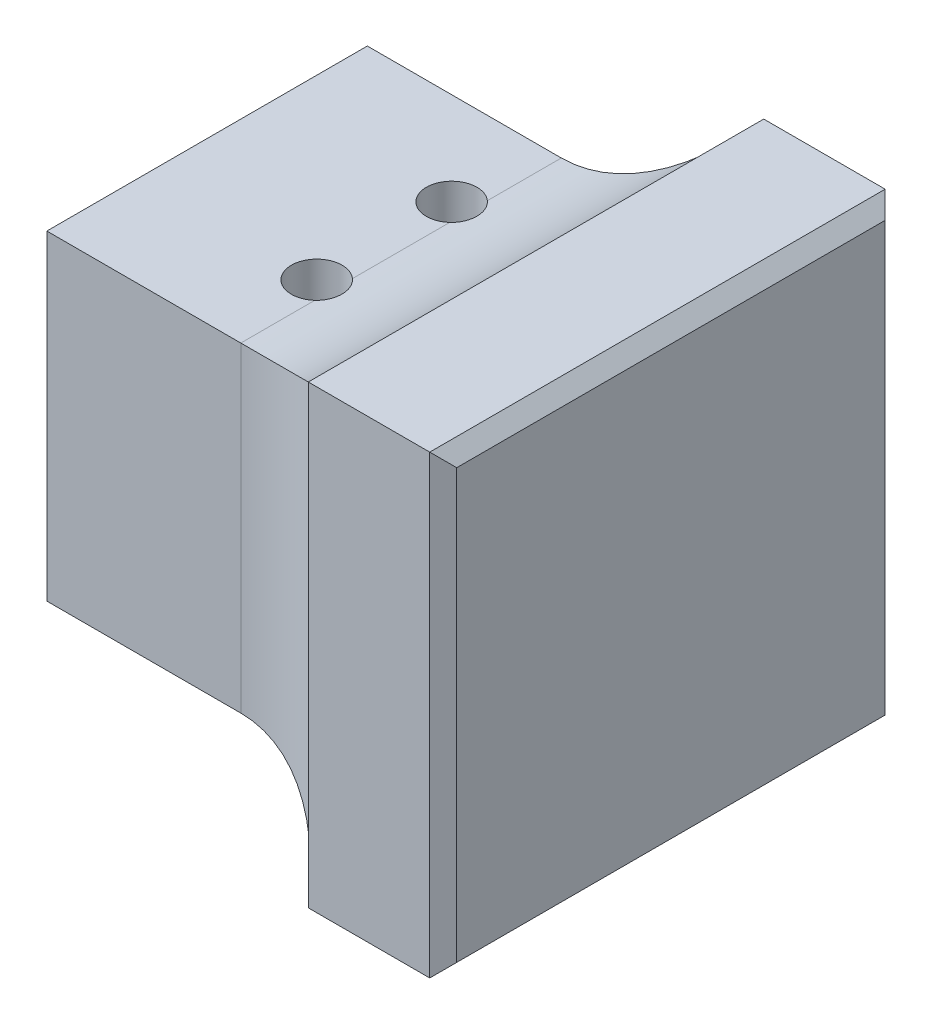
ISO-10303-21;
HEADER;
FILE_DESCRIPTION(('STEP AP214'),'2;1');
FILE_NAME('part.step','',(''),(''),'','','');
FILE_SCHEMA(('AUTOMOTIVE_DESIGN { 1 0 10303 214 1 1 1 1 }'));
ENDSEC;
DATA;
#1=APPLICATION_CONTEXT('core data for automotive mechanical design processes');
#2=APPLICATION_PROTOCOL_DEFINITION('international standard','automotive_design',2000,#1);
#3=PRODUCT_CONTEXT('',#1,'mechanical');
#4=PRODUCT('Part','Part','',(#3));
#5=PRODUCT_RELATED_PRODUCT_CATEGORY('part','',(#4));
#6=PRODUCT_DEFINITION_FORMATION('','',#4);
#7=PRODUCT_DEFINITION_CONTEXT('part definition',#1,'design');
#8=PRODUCT_DEFINITION('design','',#6,#7);
#9=PRODUCT_DEFINITION_SHAPE('','',#8);
#10=(LENGTH_UNIT() NAMED_UNIT(*) SI_UNIT(.MILLI.,.METRE.));
#11=(NAMED_UNIT(*) PLANE_ANGLE_UNIT() SI_UNIT($,.RADIAN.));
#12=(NAMED_UNIT(*) SI_UNIT($,.STERADIAN.) SOLID_ANGLE_UNIT());
#13=UNCERTAINTY_MEASURE_WITH_UNIT(LENGTH_MEASURE(1.E-05),#10,'distance_accuracy_value','');
#14=(GEOMETRIC_REPRESENTATION_CONTEXT(3) GLOBAL_UNCERTAINTY_ASSIGNED_CONTEXT((#13)) GLOBAL_UNIT_ASSIGNED_CONTEXT((#10,
#11,#12)) REPRESENTATION_CONTEXT('',''));
#15=CARTESIAN_POINT('',(0.,0.,0.));
#16=DIRECTION('',(0.,0.,1.));
#17=DIRECTION('',(1.,0.,0.));
#18=AXIS2_PLACEMENT_3D('',#15,#16,#17);
#19=CARTESIAN_POINT('',(0.,19.,0.));
#20=DIRECTION('',(0.,-1.,0.));
#21=DIRECTION('',(0.,0.,-1.));
#22=AXIS2_PLACEMENT_3D('',#19,#20,#21);
#23=PLANE('',#22);
#24=DIRECTION('',(1.,0.,0.));
#25=VECTOR('',#24,1.);
#26=CARTESIAN_POINT('',(0.,19.,0.));
#27=LINE('',#26,#25);
#28=CARTESIAN_POINT('',(1.50000000000001,19.,0.));
#29=VERTEX_POINT('',#28);
#30=CARTESIAN_POINT('',(13.,19.,0.));
#31=VERTEX_POINT('',#30);
#32=EDGE_CURVE('E208',#29,#31,#27,.T.);
#33=ORIENTED_EDGE('',*,*,#32,.T.);
#34=DIRECTION('',(0.,0.,1.));
#35=VECTOR('',#34,1.);
#36=CARTESIAN_POINT('',(13.,19.,0.));
#37=LINE('',#36,#35);
#38=CARTESIAN_POINT('',(13.,19.,-4.3819660112501));
#39=VERTEX_POINT('',#38);
#40=EDGE_CURVE('E257',#31,#39,#37,.F.);
#41=ORIENTED_EDGE('',*,*,#40,.T.);
#42=CARTESIAN_POINT('',(12.,19.,-5.5));
#43=DIRECTION('',(0.,1.,0.));
#44=DIRECTION('',(0.,0.,1.));
#45=AXIS2_PLACEMENT_3D('',#42,#43,#44);
#46=CIRCLE('',#45,1.5);
#47=CARTESIAN_POINT('',(13.,19.,-6.6180339887499));
#48=VERTEX_POINT('',#47);
#49=EDGE_CURVE('E194',#48,#39,#46,.T.);
#50=ORIENTED_EDGE('',*,*,#49,.F.);
#51=DIRECTION('',(0.,0.,1.));
#52=VECTOR('',#51,1.);
#53=CARTESIAN_POINT('',(13.,19.,0.));
#54=LINE('',#53,#52);
#55=CARTESIAN_POINT('',(13.,19.,-12.3819660112501));
#56=VERTEX_POINT('',#55);
#57=EDGE_CURVE('E255',#48,#56,#54,.F.);
#58=ORIENTED_EDGE('',*,*,#57,.T.);
#59=CARTESIAN_POINT('',(12.,19.,-13.5));
#60=DIRECTION('',(0.,1.,0.));
#61=DIRECTION('',(0.,0.,1.));
#62=AXIS2_PLACEMENT_3D('',#59,#60,#61);
#63=CIRCLE('',#62,1.5);
#64=CARTESIAN_POINT('',(13.,19.,-14.6180339887499));
#65=VERTEX_POINT('',#64);
#66=EDGE_CURVE('E202',#65,#56,#63,.T.);
#67=ORIENTED_EDGE('',*,*,#66,.F.);
#68=DIRECTION('',(0.,0.,1.));
#69=VECTOR('',#68,1.);
#70=CARTESIAN_POINT('',(13.,19.,0.));
#71=LINE('',#70,#69);
#72=CARTESIAN_POINT('',(13.,19.,-19.));
#73=VERTEX_POINT('',#72);
#74=EDGE_CURVE('E253',#65,#73,#71,.F.);
#75=ORIENTED_EDGE('',*,*,#74,.T.);
#76=DIRECTION('',(-1.,0.,0.));
#77=VECTOR('',#76,1.);
#78=CARTESIAN_POINT('',(0.,19.,-19.));
#79=LINE('',#78,#77);
#80=CARTESIAN_POINT('',(1.50000000000001,19.,-19.));
#81=VERTEX_POINT('',#80);
#82=EDGE_CURVE('E211',#73,#81,#79,.T.);
#83=ORIENTED_EDGE('',*,*,#82,.T.);
#84=DIRECTION('',(0.,0.,1.));
#85=VECTOR('',#84,1.);
#86=CARTESIAN_POINT('',(1.50000000000001,19.,0.));
#87=LINE('',#86,#85);
#88=EDGE_CURVE('E229',#81,#29,#87,.T.);
#89=ORIENTED_EDGE('',*,*,#88,.T.);
#90=EDGE_LOOP('',(#33,#41,#50,#58,#67,#75,#83,#89));
#91=FACE_BOUND('',#90,.T.);
#92=ADVANCED_FACE('F34',(#91),#23,.F.);
#93=CARTESIAN_POINT('',(0.,0.,0.));
#94=DIRECTION('',(0.,-1.,0.));
#95=DIRECTION('',(0.,0.,-1.));
#96=AXIS2_PLACEMENT_3D('',#93,#94,#95);
#97=PLANE('',#96);
#98=DIRECTION('',(-1.,0.,0.));
#99=VECTOR('',#98,1.);
#100=CARTESIAN_POINT('',(0.,0.,-19.));
#101=LINE('',#100,#99);
#102=CARTESIAN_POINT('',(13.,0.,-19.));
#103=VERTEX_POINT('',#102);
#104=CARTESIAN_POINT('',(1.50000000000001,0.,-19.));
#105=VERTEX_POINT('',#104);
#106=EDGE_CURVE('E212',#103,#105,#101,.T.);
#107=ORIENTED_EDGE('',*,*,#106,.F.);
#108=DIRECTION('',(0.,0.,1.));
#109=VECTOR('',#108,1.);
#110=CARTESIAN_POINT('',(13.,0.,0.));
#111=LINE('',#110,#109);
#112=CARTESIAN_POINT('',(13.,0.,-14.6180339887499));
#113=VERTEX_POINT('',#112);
#114=EDGE_CURVE('E249',#103,#113,#111,.T.);
#115=ORIENTED_EDGE('',*,*,#114,.T.);
#116=CARTESIAN_POINT('',(12.,0.,-13.5));
#117=DIRECTION('',(0.,1.,0.));
#118=DIRECTION('',(0.,0.,1.));
#119=AXIS2_PLACEMENT_3D('',#116,#117,#118);
#120=CIRCLE('',#119,1.5);
#121=CARTESIAN_POINT('',(13.,0.,-12.3819660112501));
#122=VERTEX_POINT('',#121);
#123=EDGE_CURVE('E197',#113,#122,#120,.T.);
#124=ORIENTED_EDGE('',*,*,#123,.T.);
#125=DIRECTION('',(0.,0.,1.));
#126=VECTOR('',#125,1.);
#127=CARTESIAN_POINT('',(13.,0.,0.));
#128=LINE('',#127,#126);
#129=CARTESIAN_POINT('',(13.,0.,-6.6180339887499));
#130=VERTEX_POINT('',#129);
#131=EDGE_CURVE('E247',#122,#130,#128,.T.);
#132=ORIENTED_EDGE('',*,*,#131,.T.);
#133=CARTESIAN_POINT('',(12.,0.,-5.5));
#134=DIRECTION('',(0.,1.,0.));
#135=DIRECTION('',(0.,0.,1.));
#136=AXIS2_PLACEMENT_3D('',#133,#134,#135);
#137=CIRCLE('',#136,1.5);
#138=CARTESIAN_POINT('',(13.,0.,-4.3819660112501));
#139=VERTEX_POINT('',#138);
#140=EDGE_CURVE('E198',#130,#139,#137,.T.);
#141=ORIENTED_EDGE('',*,*,#140,.T.);
#142=DIRECTION('',(0.,0.,1.));
#143=VECTOR('',#142,1.);
#144=CARTESIAN_POINT('',(13.,0.,0.));
#145=LINE('',#144,#143);
#146=CARTESIAN_POINT('',(13.,0.,0.));
#147=VERTEX_POINT('',#146);
#148=EDGE_CURVE('E236',#139,#147,#145,.T.);
#149=ORIENTED_EDGE('',*,*,#148,.T.);
#150=DIRECTION('',(1.,0.,0.));
#151=VECTOR('',#150,1.);
#152=CARTESIAN_POINT('',(0.,0.,0.));
#153=LINE('',#152,#151);
#154=CARTESIAN_POINT('',(1.50000000000001,0.,0.));
#155=VERTEX_POINT('',#154);
#156=EDGE_CURVE('E205',#155,#147,#153,.T.);
#157=ORIENTED_EDGE('',*,*,#156,.F.);
#158=DIRECTION('',(0.,0.,-1.));
#159=VECTOR('',#158,1.);
#160=CARTESIAN_POINT('',(1.50000000000001,0.,-19.));
#161=LINE('',#160,#159);
#162=EDGE_CURVE('E233',#155,#105,#161,.T.);
#163=ORIENTED_EDGE('',*,*,#162,.T.);
#164=EDGE_LOOP('',(#107,#115,#124,#132,#141,#149,#157,#163));
#165=FACE_BOUND('',#164,.T.);
#166=ADVANCED_FACE('F337',(#165),#97,.T.);
#167=CARTESIAN_POINT('',(0.,19.,0.));
#168=DIRECTION('',(1.,0.,0.));
#169=DIRECTION('',(0.,0.,-1.));
#170=AXIS2_PLACEMENT_3D('',#167,#168,#169);
#171=PLANE('',#170);
#172=DIRECTION('',(0.,0.,-1.));
#173=VECTOR('',#172,1.);
#174=CARTESIAN_POINT('',(0.,17.5,0.));
#175=LINE('',#174,#173);
#176=CARTESIAN_POINT('',(0.,17.5,-1.5));
#177=VERTEX_POINT('',#176);
#178=CARTESIAN_POINT('',(0.,17.5,-17.5));
#179=VERTEX_POINT('',#178);
#180=EDGE_CURVE('E221',#177,#179,#175,.T.);
#181=ORIENTED_EDGE('',*,*,#180,.T.);
#182=DIRECTION('',(0.,-1.,0.));
#183=VECTOR('',#182,1.);
#184=CARTESIAN_POINT('',(0.,19.,-17.5));
#185=LINE('',#184,#183);
#186=CARTESIAN_POINT('',(0.,1.5,-17.5));
#187=VERTEX_POINT('',#186);
#188=EDGE_CURVE('E223',#179,#187,#185,.T.);
#189=ORIENTED_EDGE('',*,*,#188,.T.);
#190=DIRECTION('',(0.,0.,1.));
#191=VECTOR('',#190,1.);
#192=CARTESIAN_POINT('',(0.,1.5,0.));
#193=LINE('',#192,#191);
#194=CARTESIAN_POINT('',(0.,1.5,-1.5));
#195=VERTEX_POINT('',#194);
#196=EDGE_CURVE('E214',#187,#195,#193,.T.);
#197=ORIENTED_EDGE('',*,*,#196,.T.);
#198=DIRECTION('',(0.,1.,0.));
#199=VECTOR('',#198,1.);
#200=CARTESIAN_POINT('',(0.,19.,-1.5));
#201=LINE('',#200,#199);
#202=EDGE_CURVE('E219',#195,#177,#201,.T.);
#203=ORIENTED_EDGE('',*,*,#202,.T.);
#204=EDGE_LOOP('',(#181,#189,#197,#203));
#205=FACE_BOUND('',#204,.T.);
#206=ADVANCED_FACE('F342',(#205),#171,.F.);
#207=CARTESIAN_POINT('',(0.,19.,0.));
#208=DIRECTION('',(0.,0.,-1.));
#209=DIRECTION('',(-1.,0.,0.));
#210=AXIS2_PLACEMENT_3D('',#207,#208,#209);
#211=PLANE('',#210);
#212=ORIENTED_EDGE('',*,*,#156,.T.);
#213=DIRECTION('',(0.,-1.,0.));
#214=VECTOR('',#213,1.);
#215=CARTESIAN_POINT('',(13.,19.,0.));
#216=LINE('',#215,#214);
#217=EDGE_CURVE('E172',#147,#31,#216,.F.);
#218=ORIENTED_EDGE('',*,*,#217,.T.);
#219=ORIENTED_EDGE('',*,*,#32,.F.);
#220=DIRECTION('',(0.,-1.,0.));
#221=VECTOR('',#220,1.);
#222=CARTESIAN_POINT('',(1.50000000000001,19.,0.));
#223=LINE('',#222,#221);
#224=EDGE_CURVE('E231',#29,#155,#223,.T.);
#225=ORIENTED_EDGE('',*,*,#224,.T.);
#226=EDGE_LOOP('',(#212,#218,#219,#225));
#227=FACE_BOUND('',#226,.T.);
#228=ADVANCED_FACE('F463',(#227),#211,.F.);
#229=CARTESIAN_POINT('',(0.,19.,-19.));
#230=DIRECTION('',(0.,0.,1.));
#231=DIRECTION('',(1.,0.,0.));
#232=AXIS2_PLACEMENT_3D('',#229,#230,#231);
#233=PLANE('',#232);
#234=ORIENTED_EDGE('',*,*,#82,.F.);
#235=DIRECTION('',(0.,1.,0.));
#236=VECTOR('',#235,1.);
#237=CARTESIAN_POINT('',(13.,19.,-19.));
#238=LINE('',#237,#236);
#239=EDGE_CURVE('E259',#73,#103,#238,.F.);
#240=ORIENTED_EDGE('',*,*,#239,.T.);
#241=ORIENTED_EDGE('',*,*,#106,.T.);
#242=DIRECTION('',(0.,1.,0.));
#243=VECTOR('',#242,1.);
#244=CARTESIAN_POINT('',(1.50000000000001,19.,-19.));
#245=LINE('',#244,#243);
#246=EDGE_CURVE('E226',#105,#81,#245,.T.);
#247=ORIENTED_EDGE('',*,*,#246,.T.);
#248=EDGE_LOOP('',(#234,#240,#241,#247));
#249=FACE_BOUND('',#248,.T.);
#250=ADVANCED_FACE('F284',(#249),#233,.F.);
#251=CARTESIAN_POINT('',(12.,19.,-13.5));
#252=DIRECTION('',(0.,-1.,0.));
#253=DIRECTION('',(0.,0.,-1.));
#254=AXIS2_PLACEMENT_3D('',#251,#252,#253);
#255=CYLINDRICAL_SURFACE('',#254,1.5);
#256=ORIENTED_EDGE('',*,*,#66,.T.);
#257=CARTESIAN_POINT('',(13.,19.,-12.3819660112501));
#258=CARTESIAN_POINT('',(13.0314450404899,18.9999998726787,-12.4100916145278));
#259=CARTESIAN_POINT('',(13.0616877126082,19.0001483195721,-12.4395305646093));
#260=CARTESIAN_POINT('',(13.11958533255,19.0006731951688,-12.5008461926024));
#261=CARTESIAN_POINT('',(13.147240450336,19.001049608886,-12.532722710153));
#262=CARTESIAN_POINT('',(13.2259673309586,19.0024155614752,-12.6316196293879));
#263=CARTESIAN_POINT('',(13.2729079584842,19.0036422790425,-12.7020036008032));
#264=CARTESIAN_POINT('',(13.3543090234248,19.0061951686628,-12.849641836415));
#265=CARTESIAN_POINT('',(13.38876420903,19.0075213822848,-12.926898974725));
#266=CARTESIAN_POINT('',(13.444226606692,19.009832989572,-13.086104044917));
#267=CARTESIAN_POINT('',(13.4652355064595,19.0108184260027,-13.168051386701));
#268=CARTESIAN_POINT('',(13.4932090795529,19.0121601749367,-13.3343487399693));
#269=CARTESIAN_POINT('',(13.5001676700621,19.0125162149464,-13.4186997760686));
#270=CARTESIAN_POINT('',(13.4998261827595,19.0124991218505,-13.5873733641284));
#271=CARTESIAN_POINT('',(13.4925260483815,19.0121259858523,-13.6716959159745));
#272=CARTESIAN_POINT('',(13.4638896426427,19.0107553772105,-13.837819808609));
#273=CARTESIAN_POINT('',(13.4425694184112,19.0097586184171,-13.919623920032));
#274=CARTESIAN_POINT('',(13.3865218211718,19.0074335779821,-14.0784956915318));
#275=CARTESIAN_POINT('',(13.351793076779,19.0061052624347,-14.1555628661935));
#276=CARTESIAN_POINT('',(13.270321818354,19.0035727416623,-14.3020085789191));
#277=CARTESIAN_POINT('',(13.2237144620733,19.0023673408445,-14.3714618051311));
#278=CARTESIAN_POINT('',(13.1456875720227,19.0010274701353,-14.4690951664263));
#279=CARTESIAN_POINT('',(13.1183013358164,19.0006587801918,-14.5005706143263));
#280=CARTESIAN_POINT('',(13.0610018630657,19.0001449768385,-14.5611368254208));
#281=CARTESIAN_POINT('',(13.0310884442664,18.9999998795683,-14.590227416326));
#282=CARTESIAN_POINT('',(13.,19.,-14.6180339887499));
#283=B_SPLINE_CURVE_WITH_KNOTS('',3,(#257,#258,#259,#260,#261,#262,#263,#264,#265,#266,#267,
#268,#269,#270,#271,#272,#273,#274,#275,#276,#277,#278,#279,#280,#281,#282),.UNSPECIFIED.,.F.,
.F.,(4,2,2,2,2,2,2,2,2,2,2,2,4),(0.,0.126485905607502,0.252963497196041,0.505491772367126,
0.758126146723127,1.0107288054512,1.2634408003114,1.516153797714,1.7685780468891,
2.02102812013116,2.27072487574267,2.39576922278843,2.52082259547005),.UNSPECIFIED.);
#284=EDGE_CURVE('E291',#56,#65,#283,.T.);
#285=ORIENTED_EDGE('',*,*,#284,.T.);
#286=EDGE_LOOP('',(#256,#285));
#287=FACE_BOUND('',#286,.T.);
#288=ORIENTED_EDGE('',*,*,#123,.F.);
#289=CARTESIAN_POINT('',(13.,0.,-14.6180339887499));
#290=CARTESIAN_POINT('',(13.0314450404899,1.27321317800919E-07,-14.5899083854722));
#291=CARTESIAN_POINT('',(13.0616877126082,-0.00014831957213464,-14.5604694353907));
#292=CARTESIAN_POINT('',(13.11958533255,-0.000673195168825452,-14.4991538073976));
#293=CARTESIAN_POINT('',(13.147240450336,-0.00104960888599716,-14.467277289847));
#294=CARTESIAN_POINT('',(13.2259673309586,-0.00241556147519206,-14.3683803706121));
#295=CARTESIAN_POINT('',(13.2729079584842,-0.00364227904253221,-14.2979963991968));
#296=CARTESIAN_POINT('',(13.3543090234248,-0.00619516866281442,-14.150358163585));
#297=CARTESIAN_POINT('',(13.38876420903,-0.0075213822847889,-14.073101025275));
#298=CARTESIAN_POINT('',(13.444226606692,-0.00983298957198408,-13.913895955083));
#299=CARTESIAN_POINT('',(13.4652355064595,-0.0108184260027174,-13.831948613299));
#300=CARTESIAN_POINT('',(13.4932090795529,-0.0121601749367112,-13.6656512600307));
#301=CARTESIAN_POINT('',(13.5001676700621,-0.0125162149463531,-13.5813002239314));
#302=CARTESIAN_POINT('',(13.4998261827595,-0.0124991218504954,-13.4126266358716));
#303=CARTESIAN_POINT('',(13.4925260483815,-0.0121259858522626,-13.3283040840255));
#304=CARTESIAN_POINT('',(13.4638896426427,-0.0107553772105174,-13.162180191391));
#305=CARTESIAN_POINT('',(13.4425694184112,-0.0097586184171326,-13.080376079968));
#306=CARTESIAN_POINT('',(13.3865218211718,-0.00743357798211628,-12.9215043084682));
#307=CARTESIAN_POINT('',(13.3517930767789,-0.00610526243472923,-12.8444371338065));
#308=CARTESIAN_POINT('',(13.270321818354,-0.00357274166233139,-12.6979914210809));
#309=CARTESIAN_POINT('',(13.2237144620733,-0.00236734084450203,-12.6285381948689));
#310=CARTESIAN_POINT('',(13.1456875720227,-0.00102747013534093,-12.5309048335737));
#311=CARTESIAN_POINT('',(13.1183013358164,-0.000658780191829888,-12.4994293856737));
#312=CARTESIAN_POINT('',(13.0610018630657,-0.000144976838534495,-12.4388631745792));
#313=CARTESIAN_POINT('',(13.0310884442664,1.20431691219609E-07,-12.409772583674));
#314=CARTESIAN_POINT('',(13.,0.,-12.3819660112501));
#315=B_SPLINE_CURVE_WITH_KNOTS('',3,(#289,#290,#291,#292,#293,#294,#295,#296,#297,#298,#299,
#300,#301,#302,#303,#304,#305,#306,#307,#308,#309,#310,#311,#312,#313,#314),.UNSPECIFIED.,.F.,
.F.,(4,2,2,2,2,2,2,2,2,2,2,2,4),(0.,0.1264859056075,0.252963497196042,0.505491772367128,
0.758126146723129,1.01072880545121,1.26344080031141,1.51615379771401,1.7685780468891,
2.02102812013117,2.27072487574267,2.39576922278842,2.52082259547005),.UNSPECIFIED.);
#316=EDGE_CURVE('E261',#113,#122,#315,.T.);
#317=ORIENTED_EDGE('',*,*,#316,.T.);
#318=EDGE_LOOP('',(#288,#317));
#319=FACE_BOUND('',#318,.T.);
#320=ADVANCED_FACE('F279',(#287,#319),#255,.F.);
#321=CARTESIAN_POINT('',(12.,19.,-5.5));
#322=DIRECTION('',(0.,-1.,0.));
#323=DIRECTION('',(0.,0.,-1.));
#324=AXIS2_PLACEMENT_3D('',#321,#322,#323);
#325=CYLINDRICAL_SURFACE('',#324,1.5);
#326=ORIENTED_EDGE('',*,*,#49,.T.);
#327=CARTESIAN_POINT('',(13.,19.,-4.3819660112501));
#328=CARTESIAN_POINT('',(13.0314450404899,18.9999998726787,-4.4100916145278));
#329=CARTESIAN_POINT('',(13.0616877126082,19.0001483195721,-4.4395305646093));
#330=CARTESIAN_POINT('',(13.11958533255,19.0006731951688,-4.50084619260239));
#331=CARTESIAN_POINT('',(13.147240450336,19.001049608886,-4.53272271015302));
#332=CARTESIAN_POINT('',(13.2259673309586,19.0024155614752,-4.63161962938787));
#333=CARTESIAN_POINT('',(13.2729079584842,19.0036422790425,-4.7020036008032));
#334=CARTESIAN_POINT('',(13.3543090234248,19.0061951686628,-4.84964183641499));
#335=CARTESIAN_POINT('',(13.38876420903,19.0075213822848,-4.92689897472498));
#336=CARTESIAN_POINT('',(13.444226606692,19.009832989572,-5.08610404491703));
#337=CARTESIAN_POINT('',(13.4652355064595,19.0108184260027,-5.16805138670098));
#338=CARTESIAN_POINT('',(13.4932090795529,19.0121601749367,-5.33434873996927));
#339=CARTESIAN_POINT('',(13.5001676700621,19.0125162149464,-5.41869977606858));
#340=CARTESIAN_POINT('',(13.4998261827595,19.0124991218505,-5.58737336412837));
#341=CARTESIAN_POINT('',(13.4925260483815,19.0121259858523,-5.67169591597453));
#342=CARTESIAN_POINT('',(13.4638896426427,19.0107553772105,-5.83781980860904));
#343=CARTESIAN_POINT('',(13.4425694184112,19.0097586184171,-5.91962392003199));
#344=CARTESIAN_POINT('',(13.3865218211718,19.0074335779821,-6.0784956915318));
#345=CARTESIAN_POINT('',(13.3517930767789,19.0061052624347,-6.15556286619351));
#346=CARTESIAN_POINT('',(13.270321818354,19.0035727416623,-6.30200857891914));
#347=CARTESIAN_POINT('',(13.2237144620733,19.0023673408445,-6.37146180513108));
#348=CARTESIAN_POINT('',(13.1456875720227,19.0010274701353,-6.4690951664263));
#349=CARTESIAN_POINT('',(13.1183013358164,19.0006587801918,-6.50057061432631));
#350=CARTESIAN_POINT('',(13.0610018630657,19.0001449768385,-6.56113682542082));
#351=CARTESIAN_POINT('',(13.0310884442664,18.9999998795683,-6.59022741632604));
#352=CARTESIAN_POINT('',(13.,19.,-6.6180339887499));
#353=B_SPLINE_CURVE_WITH_KNOTS('',3,(#327,#328,#329,#330,#331,#332,#333,#334,#335,#336,#337,
#338,#339,#340,#341,#342,#343,#344,#345,#346,#347,#348,#349,#350,#351,#352),.UNSPECIFIED.,.F.,
.F.,(4,2,2,2,2,2,2,2,2,2,2,2,4),(0.,0.126485905607502,0.252963497196041,0.505491772367128,
0.758126146723129,1.01072880545121,1.26344080031141,1.51615379771401,1.7685780468891,
2.02102812013116,2.27072487574267,2.39576922278843,2.52082259547005),.UNSPECIFIED.);
#354=EDGE_CURVE('E299',#39,#48,#353,.T.);
#355=ORIENTED_EDGE('',*,*,#354,.T.);
#356=EDGE_LOOP('',(#326,#355));
#357=FACE_BOUND('',#356,.T.);
#358=ORIENTED_EDGE('',*,*,#140,.F.);
#359=CARTESIAN_POINT('',(13.,0.,-6.6180339887499));
#360=CARTESIAN_POINT('',(13.0314450404899,1.27321319033027E-07,-6.58990838547219));
#361=CARTESIAN_POINT('',(13.0616877126082,-0.000148319572133448,-6.5604694353907));
#362=CARTESIAN_POINT('',(13.11958533255,-0.000673195168825114,-6.4991538073976));
#363=CARTESIAN_POINT('',(13.147240450336,-0.00104960888599763,-6.46727728984698));
#364=CARTESIAN_POINT('',(13.2259673309586,-0.00241556147519346,-6.36838037061213));
#365=CARTESIAN_POINT('',(13.2729079584842,-0.00364227904253228,-6.2979963991968));
#366=CARTESIAN_POINT('',(13.3543090234248,-0.00619516866281433,-6.15035816358501));
#367=CARTESIAN_POINT('',(13.38876420903,-0.00752138228478999,-6.07310102527502));
#368=CARTESIAN_POINT('',(13.444226606692,-0.00983298957198436,-5.91389595508297));
#369=CARTESIAN_POINT('',(13.4652355064595,-0.0108184260027157,-5.83194861329902));
#370=CARTESIAN_POINT('',(13.4932090795529,-0.0121601749367094,-5.66565126003073));
#371=CARTESIAN_POINT('',(13.5001676700621,-0.0125162149463533,-5.58130022393142));
#372=CARTESIAN_POINT('',(13.4998261827595,-0.0124991218504965,-5.41262663587163));
#373=CARTESIAN_POINT('',(13.4925260483815,-0.0121259858522627,-5.32830408402547));
#374=CARTESIAN_POINT('',(13.4638896426427,-0.0107553772105171,-5.16218019139096));
#375=CARTESIAN_POINT('',(13.4425694184112,-0.00975861841713272,-5.08037607996801));
#376=CARTESIAN_POINT('',(13.3865218211718,-0.00743357798211664,-4.9215043084682));
#377=CARTESIAN_POINT('',(13.3517930767789,-0.00610526243472935,-4.84443713380649));
#378=CARTESIAN_POINT('',(13.270321818354,-0.00357274166233119,-4.69799142108086));
#379=CARTESIAN_POINT('',(13.2237144620733,-0.00236734084450174,-4.62853819486892));
#380=CARTESIAN_POINT('',(13.1456875720227,-0.00102747013534062,-4.5309048335737));
#381=CARTESIAN_POINT('',(13.1183013358164,-0.000658780191829589,-4.49942938567369));
#382=CARTESIAN_POINT('',(13.0610018630657,-0.00014497683853426,-4.43886317457918));
#383=CARTESIAN_POINT('',(13.0310884442664,1.20431691403744E-07,-4.40977258367396));
#384=CARTESIAN_POINT('',(13.,0.,-4.3819660112501));
#385=B_SPLINE_CURVE_WITH_KNOTS('',3,(#359,#360,#361,#362,#363,#364,#365,#366,#367,#368,#369,
#370,#371,#372,#373,#374,#375,#376,#377,#378,#379,#380,#381,#382,#383,#384),.UNSPECIFIED.,.F.,
.F.,(4,2,2,2,2,2,2,2,2,2,2,2,4),(0.,0.126485905607502,0.252963497196041,0.505491772367126,
0.758126146723126,1.0107288054512,1.26344080031141,1.51615379771401,1.7685780468891,
2.02102812013116,2.27072487574267,2.39576922278842,2.52082259547005),.UNSPECIFIED.);
#386=EDGE_CURVE('E269',#130,#139,#385,.T.);
#387=ORIENTED_EDGE('',*,*,#386,.T.);
#388=EDGE_LOOP('',(#358,#387));
#389=FACE_BOUND('',#388,.T.);
#390=ADVANCED_FACE('F283',(#357,#389),#325,.F.);
#391=CARTESIAN_POINT('',(1.50000000000001,19.,0.));
#392=DIRECTION('',(0.707106781186547,0.,-0.707106781186548));
#393=DIRECTION('',(0.,-1.,0.));
#394=AXIS2_PLACEMENT_3D('',#391,#392,#393);
#395=PLANE('',#394);
#396=DIRECTION('',(0.577350269189627,-0.577350269189625,0.577350269189625));
#397=VECTOR('',#396,1.);
#398=CARTESIAN_POINT('',(0.500000000000002,1.,-1.));
#399=LINE('',#398,#397);
#400=EDGE_CURVE('E241',#155,#195,#399,.F.);
#401=ORIENTED_EDGE('',*,*,#400,.F.);
#402=ORIENTED_EDGE('',*,*,#224,.F.);
#403=DIRECTION('',(-0.577350269189627,-0.577350269189625,-0.577350269189625));
#404=VECTOR('',#403,1.);
#405=CARTESIAN_POINT('',(1.50000000000001,19.,0.));
#406=LINE('',#405,#404);
#407=EDGE_CURVE('E201',#177,#29,#406,.F.);
#408=ORIENTED_EDGE('',*,*,#407,.F.);
#409=ORIENTED_EDGE('',*,*,#202,.F.);
#410=EDGE_LOOP('',(#401,#402,#408,#409));
#411=FACE_BOUND('',#410,.T.);
#412=ADVANCED_FACE('F427',(#411),#395,.F.);
#413=CARTESIAN_POINT('',(1.50000000000001,19.,0.));
#414=DIRECTION('',(0.707106781186547,-0.707106781186548,0.));
#415=DIRECTION('',(0.,0.,1.));
#416=AXIS2_PLACEMENT_3D('',#413,#414,#415);
#417=PLANE('',#416);
#418=ORIENTED_EDGE('',*,*,#407,.T.);
#419=ORIENTED_EDGE('',*,*,#88,.F.);
#420=DIRECTION('',(-0.577350269189627,-0.577350269189625,0.577350269189625));
#421=VECTOR('',#420,1.);
#422=CARTESIAN_POINT('',(-4.83333333333333,12.6666666666667,-12.6666666666667));
#423=LINE('',#422,#421);
#424=EDGE_CURVE('E238',#179,#81,#423,.F.);
#425=ORIENTED_EDGE('',*,*,#424,.F.);
#426=ORIENTED_EDGE('',*,*,#180,.F.);
#427=EDGE_LOOP('',(#418,#419,#425,#426));
#428=FACE_BOUND('',#427,.T.);
#429=ADVANCED_FACE('F410',(#428),#417,.F.);
#430=CARTESIAN_POINT('',(0.,1.5,0.));
#431=DIRECTION('',(-0.707106781186547,-0.707106781186548,0.));
#432=DIRECTION('',(0.,0.,-1.));
#433=AXIS2_PLACEMENT_3D('',#430,#431,#432);
#434=PLANE('',#433);
#435=ORIENTED_EDGE('',*,*,#400,.T.);
#436=ORIENTED_EDGE('',*,*,#196,.F.);
#437=DIRECTION('',(-0.577350269189627,0.577350269189625,0.577350269189625));
#438=VECTOR('',#437,1.);
#439=CARTESIAN_POINT('',(-5.83333333333334,7.33333333333333,-11.6666666666667));
#440=LINE('',#439,#438);
#441=EDGE_CURVE('E154',#105,#187,#440,.T.);
#442=ORIENTED_EDGE('',*,*,#441,.F.);
#443=ORIENTED_EDGE('',*,*,#162,.F.);
#444=EDGE_LOOP('',(#435,#436,#442,#443));
#445=FACE_BOUND('',#444,.T.);
#446=ADVANCED_FACE('F404',(#445),#434,.T.);
#447=CARTESIAN_POINT('',(0.,19.,-17.5));
#448=DIRECTION('',(0.707106781186547,0.,0.707106781186548));
#449=DIRECTION('',(0.,-1.,0.));
#450=AXIS2_PLACEMENT_3D('',#447,#448,#449);
#451=PLANE('',#450);
#452=ORIENTED_EDGE('',*,*,#424,.T.);
#453=ORIENTED_EDGE('',*,*,#246,.F.);
#454=ORIENTED_EDGE('',*,*,#441,.T.);
#455=ORIENTED_EDGE('',*,*,#188,.F.);
#456=EDGE_LOOP('',(#452,#453,#454,#455));
#457=FACE_BOUND('',#456,.T.);
#458=ADVANCED_FACE('F400',(#457),#451,.F.);
#459=CARTESIAN_POINT('',(29.,-4.,4.));
#460=DIRECTION('',(0.,0.,-1.));
#461=DIRECTION('',(-1.,0.,0.));
#462=AXIS2_PLACEMENT_3D('',#459,#460,#461);
#463=PLANE('',#462);
#464=DIRECTION('',(-1.,0.,0.));
#465=VECTOR('',#464,1.);
#466=CARTESIAN_POINT('',(29.,-4.,4.));
#467=LINE('',#466,#465);
#468=CARTESIAN_POINT('',(28.2,-4.,4.));
#469=VERTEX_POINT('',#468);
#470=CARTESIAN_POINT('',(21.,-4.,4.));
#471=VERTEX_POINT('',#470);
#472=EDGE_CURVE('E147',#469,#471,#467,.T.);
#473=ORIENTED_EDGE('',*,*,#472,.F.);
#474=DIRECTION('',(0.,1.,0.));
#475=VECTOR('',#474,1.);
#476=CARTESIAN_POINT('',(28.2,-4.,4.));
#477=LINE('',#476,#475);
#478=CARTESIAN_POINT('',(28.2,23.,4.));
#479=VERTEX_POINT('',#478);
#480=EDGE_CURVE('E11',#469,#479,#477,.T.);
#481=ORIENTED_EDGE('',*,*,#480,.T.);
#482=DIRECTION('',(-1.,0.,0.));
#483=VECTOR('',#482,1.);
#484=CARTESIAN_POINT('',(29.,23.,4.));
#485=LINE('',#484,#483);
#486=CARTESIAN_POINT('',(21.,23.,4.));
#487=VERTEX_POINT('',#486);
#488=EDGE_CURVE('E162',#479,#487,#485,.T.);
#489=ORIENTED_EDGE('',*,*,#488,.T.);
#490=DIRECTION('',(0.,-1.,0.));
#491=VECTOR('',#490,1.);
#492=CARTESIAN_POINT('',(21.,-4.,4.));
#493=LINE('',#492,#491);
#494=EDGE_CURVE('E158',#487,#471,#493,.T.);
#495=ORIENTED_EDGE('',*,*,#494,.T.);
#496=EDGE_LOOP('',(#473,#481,#489,#495));
#497=FACE_BOUND('',#496,.T.);
#498=ADVANCED_FACE('F160',(#497),#463,.F.);
#499=CARTESIAN_POINT('',(29.,-4.,4.));
#500=DIRECTION('',(0.,1.,0.));
#501=DIRECTION('',(0.,0.,1.));
#502=AXIS2_PLACEMENT_3D('',#499,#500,#501);
#503=PLANE('',#502);
#504=DIRECTION('',(-1.,0.,0.));
#505=VECTOR('',#504,1.);
#506=CARTESIAN_POINT('',(29.,-4.,-23.));
#507=LINE('',#506,#505);
#508=CARTESIAN_POINT('',(28.2,-4.,-23.));
#509=VERTEX_POINT('',#508);
#510=CARTESIAN_POINT('',(21.,-4.,-23.));
#511=VERTEX_POINT('',#510);
#512=EDGE_CURVE('E155',#509,#511,#507,.T.);
#513=ORIENTED_EDGE('',*,*,#512,.F.);
#514=DIRECTION('',(0.,0.,1.));
#515=VECTOR('',#514,1.);
#516=CARTESIAN_POINT('',(28.2,-4.,4.));
#517=LINE('',#516,#515);
#518=EDGE_CURVE('E44',#509,#469,#517,.T.);
#519=ORIENTED_EDGE('',*,*,#518,.T.);
#520=ORIENTED_EDGE('',*,*,#472,.T.);
#521=DIRECTION('',(0.,0.,-1.));
#522=VECTOR('',#521,1.);
#523=CARTESIAN_POINT('',(21.,-4.,4.));
#524=LINE('',#523,#522);
#525=EDGE_CURVE('E151',#471,#511,#524,.T.);
#526=ORIENTED_EDGE('',*,*,#525,.T.);
#527=EDGE_LOOP('',(#513,#519,#520,#526));
#528=FACE_BOUND('',#527,.T.);
#529=ADVANCED_FACE('F149',(#528),#503,.F.);
#530=CARTESIAN_POINT('',(29.,-4.,-23.));
#531=DIRECTION('',(0.,0.,1.));
#532=DIRECTION('',(1.,0.,0.));
#533=AXIS2_PLACEMENT_3D('',#530,#531,#532);
#534=PLANE('',#533);
#535=DIRECTION('',(-1.,0.,0.));
#536=VECTOR('',#535,1.);
#537=CARTESIAN_POINT('',(29.,23.,-23.));
#538=LINE('',#537,#536);
#539=CARTESIAN_POINT('',(28.2,23.,-23.));
#540=VERTEX_POINT('',#539);
#541=CARTESIAN_POINT('',(21.,23.,-23.));
#542=VERTEX_POINT('',#541);
#543=EDGE_CURVE('E191',#540,#542,#538,.T.);
#544=ORIENTED_EDGE('',*,*,#543,.F.);
#545=DIRECTION('',(0.,-1.,0.));
#546=VECTOR('',#545,1.);
#547=CARTESIAN_POINT('',(28.2,-4.,-23.));
#548=LINE('',#547,#546);
#549=EDGE_CURVE('E59',#540,#509,#548,.T.);
#550=ORIENTED_EDGE('',*,*,#549,.T.);
#551=ORIENTED_EDGE('',*,*,#512,.T.);
#552=DIRECTION('',(0.,1.,0.));
#553=VECTOR('',#552,1.);
#554=CARTESIAN_POINT('',(21.,-4.,-23.));
#555=LINE('',#554,#553);
#556=EDGE_CURVE('E183',#511,#542,#555,.T.);
#557=ORIENTED_EDGE('',*,*,#556,.T.);
#558=EDGE_LOOP('',(#544,#550,#551,#557));
#559=FACE_BOUND('',#558,.T.);
#560=ADVANCED_FACE('F393',(#559),#534,.F.);
#561=CARTESIAN_POINT('',(29.,23.,4.));
#562=DIRECTION('',(0.,-1.,0.));
#563=DIRECTION('',(0.,0.,-1.));
#564=AXIS2_PLACEMENT_3D('',#561,#562,#563);
#565=PLANE('',#564);
#566=ORIENTED_EDGE('',*,*,#488,.F.);
#567=DIRECTION('',(0.,0.,-1.));
#568=VECTOR('',#567,1.);
#569=CARTESIAN_POINT('',(28.2,23.,4.));
#570=LINE('',#569,#568);
#571=EDGE_CURVE('E366',#479,#540,#570,.T.);
#572=ORIENTED_EDGE('',*,*,#571,.T.);
#573=ORIENTED_EDGE('',*,*,#543,.T.);
#574=DIRECTION('',(0.,0.,1.));
#575=VECTOR('',#574,1.);
#576=CARTESIAN_POINT('',(21.,23.,4.));
#577=LINE('',#576,#575);
#578=EDGE_CURVE('E186',#542,#487,#577,.T.);
#579=ORIENTED_EDGE('',*,*,#578,.T.);
#580=EDGE_LOOP('',(#566,#572,#573,#579));
#581=FACE_BOUND('',#580,.T.);
#582=ADVANCED_FACE('F385',(#581),#565,.F.);
#583=CARTESIAN_POINT('',(29.,0.,0.));
#584=DIRECTION('',(-1.,0.,0.));
#585=DIRECTION('',(0.,0.,1.));
#586=AXIS2_PLACEMENT_3D('',#583,#584,#585);
#587=PLANE('',#586);
#588=DIRECTION('',(0.,1.,0.));
#589=VECTOR('',#588,1.);
#590=CARTESIAN_POINT('',(29.,0.,-22.2));
#591=LINE('',#590,#589);
#592=CARTESIAN_POINT('',(29.,-3.19999999999999,-22.2));
#593=VERTEX_POINT('',#592);
#594=CARTESIAN_POINT('',(29.,22.2,-22.2));
#595=VERTEX_POINT('',#594);
#596=EDGE_CURVE('E361',#593,#595,#591,.T.);
#597=ORIENTED_EDGE('',*,*,#596,.T.);
#598=DIRECTION('',(0.,0.,1.));
#599=VECTOR('',#598,1.);
#600=CARTESIAN_POINT('',(29.,22.2,0.));
#601=LINE('',#600,#599);
#602=CARTESIAN_POINT('',(29.,22.2,3.19999999999999));
#603=VERTEX_POINT('',#602);
#604=EDGE_CURVE('E363',#595,#603,#601,.T.);
#605=ORIENTED_EDGE('',*,*,#604,.T.);
#606=DIRECTION('',(0.,-1.,0.));
#607=VECTOR('',#606,1.);
#608=CARTESIAN_POINT('',(29.,0.,3.19999999999999));
#609=LINE('',#608,#607);
#610=CARTESIAN_POINT('',(29.,-3.19999999999999,3.19999999999999));
#611=VERTEX_POINT('',#610);
#612=EDGE_CURVE('E298',#603,#611,#609,.T.);
#613=ORIENTED_EDGE('',*,*,#612,.T.);
#614=DIRECTION('',(0.,0.,-1.));
#615=VECTOR('',#614,1.);
#616=CARTESIAN_POINT('',(29.,-3.19999999999999,0.));
#617=LINE('',#616,#615);
#618=EDGE_CURVE('E359',#611,#593,#617,.T.);
#619=ORIENTED_EDGE('',*,*,#618,.T.);
#620=EDGE_LOOP('',(#597,#605,#613,#619));
#621=FACE_BOUND('',#620,.T.);
#622=ADVANCED_FACE('F309',(#621),#587,.F.);
#623=CARTESIAN_POINT('',(13.,29.,0.));
#624=DIRECTION('',(0.,0.,1.));
#625=DIRECTION('',(1.,0.,0.));
#626=AXIS2_PLACEMENT_3D('',#623,#624,#625);
#627=CYLINDRICAL_SURFACE('',#626,10.);
#628=ORIENTED_EDGE('',*,*,#354,.F.);
#629=ORIENTED_EDGE('',*,*,#40,.F.);
#630=CARTESIAN_POINT('',(13.,29.,10.));
#631=DIRECTION('',(0.,-0.707106781186547,0.707106781186547));
#632=DIRECTION('',(0.,-0.707106781186547,-0.707106781186547));
#633=AXIS2_PLACEMENT_3D('',#630,#631,#632);
#634=ELLIPSE('',#633,14.1421356237309,10.);
#635=EDGE_CURVE('E166',#487,#31,#634,.F.);
#636=ORIENTED_EDGE('',*,*,#635,.F.);
#637=ORIENTED_EDGE('',*,*,#578,.F.);
#638=CARTESIAN_POINT('',(13.,29.,-29.));
#639=DIRECTION('',(0.,0.707106781186547,0.707106781186547));
#640=DIRECTION('',(0.,0.707106781186547,-0.707106781186547));
#641=AXIS2_PLACEMENT_3D('',#638,#639,#640);
#642=ELLIPSE('',#641,14.1421356237309,10.);
#643=EDGE_CURVE('E175',#73,#542,#642,.T.);
#644=ORIENTED_EDGE('',*,*,#643,.F.);
#645=ORIENTED_EDGE('',*,*,#74,.F.);
#646=ORIENTED_EDGE('',*,*,#284,.F.);
#647=ORIENTED_EDGE('',*,*,#57,.F.);
#648=EDGE_LOOP('',(#628,#629,#636,#637,#644,#645,#646,#647));
#649=FACE_BOUND('',#648,.T.);
#650=ADVANCED_FACE('F304',(#649),#627,.F.);
#651=CARTESIAN_POINT('',(13.,0.,10.));
#652=DIRECTION('',(0.,-1.,0.));
#653=DIRECTION('',(0.,0.,-1.));
#654=AXIS2_PLACEMENT_3D('',#651,#652,#653);
#655=CYLINDRICAL_SURFACE('',#654,10.);
#656=ORIENTED_EDGE('',*,*,#635,.T.);
#657=ORIENTED_EDGE('',*,*,#217,.F.);
#658=CARTESIAN_POINT('',(13.,-10.,10.));
#659=DIRECTION('',(0.,-0.707106781186547,-0.707106781186547));
#660=DIRECTION('',(0.,-0.707106781186547,0.707106781186547));
#661=AXIS2_PLACEMENT_3D('',#658,#659,#660);
#662=ELLIPSE('',#661,14.1421356237309,10.);
#663=EDGE_CURVE('E170',#471,#147,#662,.F.);
#664=ORIENTED_EDGE('',*,*,#663,.F.);
#665=ORIENTED_EDGE('',*,*,#494,.F.);
#666=EDGE_LOOP('',(#656,#657,#664,#665));
#667=FACE_BOUND('',#666,.T.);
#668=ADVANCED_FACE('F171',(#667),#655,.F.);
#669=CARTESIAN_POINT('',(13.,0.,-29.));
#670=DIRECTION('',(0.,1.,0.));
#671=DIRECTION('',(0.,0.,1.));
#672=AXIS2_PLACEMENT_3D('',#669,#670,#671);
#673=CYLINDRICAL_SURFACE('',#672,10.);
#674=ORIENTED_EDGE('',*,*,#643,.T.);
#675=ORIENTED_EDGE('',*,*,#556,.F.);
#676=CARTESIAN_POINT('',(13.,-10.,-29.));
#677=DIRECTION('',(0.,0.707106781186547,-0.707106781186547));
#678=DIRECTION('',(0.,-0.707106781186547,-0.707106781186547));
#679=AXIS2_PLACEMENT_3D('',#676,#677,#678);
#680=ELLIPSE('',#679,14.1421356237309,10.);
#681=EDGE_CURVE('E176',#103,#511,#680,.T.);
#682=ORIENTED_EDGE('',*,*,#681,.F.);
#683=ORIENTED_EDGE('',*,*,#239,.F.);
#684=EDGE_LOOP('',(#674,#675,#682,#683));
#685=FACE_BOUND('',#684,.T.);
#686=ADVANCED_FACE('F453',(#685),#673,.F.);
#687=CARTESIAN_POINT('',(13.,-10.,0.));
#688=DIRECTION('',(0.,0.,-1.));
#689=DIRECTION('',(-1.,0.,0.));
#690=AXIS2_PLACEMENT_3D('',#687,#688,#689);
#691=CYLINDRICAL_SURFACE('',#690,10.);
#692=ORIENTED_EDGE('',*,*,#316,.F.);
#693=ORIENTED_EDGE('',*,*,#114,.F.);
#694=ORIENTED_EDGE('',*,*,#681,.T.);
#695=ORIENTED_EDGE('',*,*,#525,.F.);
#696=ORIENTED_EDGE('',*,*,#663,.T.);
#697=ORIENTED_EDGE('',*,*,#148,.F.);
#698=ORIENTED_EDGE('',*,*,#386,.F.);
#699=ORIENTED_EDGE('',*,*,#131,.F.);
#700=EDGE_LOOP('',(#692,#693,#694,#695,#696,#697,#698,#699));
#701=FACE_BOUND('',#700,.T.);
#702=ADVANCED_FACE('F179',(#701),#691,.F.);
#703=CARTESIAN_POINT('',(29.,-3.19999999999999,0.));
#704=DIRECTION('',(-0.707106781186544,0.707106781186551,0.));
#705=DIRECTION('',(0.,0.,-1.));
#706=AXIS2_PLACEMENT_3D('',#703,#704,#705);
#707=PLANE('',#706);
#708=DIRECTION('',(0.577350269189629,0.577350269189624,-0.577350269189624));
#709=VECTOR('',#708,1.);
#710=CARTESIAN_POINT('',(30.0666666666667,-2.13333333333333,2.13333333333333));
#711=LINE('',#710,#709);
#712=EDGE_CURVE('E374',#469,#611,#711,.T.);
#713=ORIENTED_EDGE('',*,*,#712,.F.);
#714=ORIENTED_EDGE('',*,*,#518,.F.);
#715=DIRECTION('',(0.577350269189629,0.577350269189624,0.577350269189624));
#716=VECTOR('',#715,1.);
#717=CARTESIAN_POINT('',(36.4,4.19999999999996,-14.8));
#718=LINE('',#717,#716);
#719=EDGE_CURVE('E39',#593,#509,#718,.F.);
#720=ORIENTED_EDGE('',*,*,#719,.F.);
#721=ORIENTED_EDGE('',*,*,#618,.F.);
#722=EDGE_LOOP('',(#713,#714,#720,#721));
#723=FACE_BOUND('',#722,.T.);
#724=ADVANCED_FACE('F37',(#723),#707,.F.);
#725=CARTESIAN_POINT('',(29.,0.,-22.2));
#726=DIRECTION('',(-0.707106781186544,0.,0.707106781186551));
#727=DIRECTION('',(0.,1.,0.));
#728=AXIS2_PLACEMENT_3D('',#725,#726,#727);
#729=PLANE('',#728);
#730=ORIENTED_EDGE('',*,*,#719,.T.);
#731=ORIENTED_EDGE('',*,*,#549,.F.);
#732=DIRECTION('',(0.577350269189629,-0.577350269189624,0.577350269189624));
#733=VECTOR('',#732,1.);
#734=CARTESIAN_POINT('',(36.4,14.8,-14.8));
#735=LINE('',#734,#733);
#736=EDGE_CURVE('E373',#595,#540,#735,.F.);
#737=ORIENTED_EDGE('',*,*,#736,.F.);
#738=ORIENTED_EDGE('',*,*,#596,.F.);
#739=EDGE_LOOP('',(#730,#731,#737,#738));
#740=FACE_BOUND('',#739,.T.);
#741=ADVANCED_FACE('F325',(#740),#729,.F.);
#742=CARTESIAN_POINT('',(29.,0.,3.19999999999999));
#743=DIRECTION('',(-0.707106781186544,0.,-0.707106781186551));
#744=DIRECTION('',(0.,-1.,0.));
#745=AXIS2_PLACEMENT_3D('',#742,#743,#744);
#746=PLANE('',#745);
#747=ORIENTED_EDGE('',*,*,#712,.T.);
#748=ORIENTED_EDGE('',*,*,#612,.F.);
#749=DIRECTION('',(-0.577350269189629,0.577350269189624,0.577350269189624));
#750=VECTOR('',#749,1.);
#751=CARTESIAN_POINT('',(36.4,14.8,-4.19999999999996));
#752=LINE('',#751,#750);
#753=EDGE_CURVE('E371',#479,#603,#752,.F.);
#754=ORIENTED_EDGE('',*,*,#753,.F.);
#755=ORIENTED_EDGE('',*,*,#480,.F.);
#756=EDGE_LOOP('',(#747,#748,#754,#755));
#757=FACE_BOUND('',#756,.T.);
#758=ADVANCED_FACE('F319',(#757),#746,.F.);
#759=CARTESIAN_POINT('',(29.,22.2,0.));
#760=DIRECTION('',(-0.707106781186544,-0.707106781186551,0.));
#761=DIRECTION('',(0.,0.,1.));
#762=AXIS2_PLACEMENT_3D('',#759,#760,#761);
#763=PLANE('',#762);
#764=ORIENTED_EDGE('',*,*,#736,.T.);
#765=ORIENTED_EDGE('',*,*,#571,.F.);
#766=ORIENTED_EDGE('',*,*,#753,.T.);
#767=ORIENTED_EDGE('',*,*,#604,.F.);
#768=EDGE_LOOP('',(#764,#765,#766,#767));
#769=FACE_BOUND('',#768,.T.);
#770=ADVANCED_FACE('F312',(#769),#763,.F.);
#771=CLOSED_SHELL('',(#92,#166,#206,#228,#250,#320,#390,#412,#429,#446,#458,#498,#529,#560,#582,
#622,#650,#668,#686,#702,#724,#741,#758,#770));
#772=MANIFOLD_SOLID_BREP('B2',#771);
#773=ADVANCED_BREP_SHAPE_REPRESENTATION('',(#18,#772),#14);
#774=SHAPE_DEFINITION_REPRESENTATION(#9,#773);
ENDSEC;
END-ISO-10303-21;
